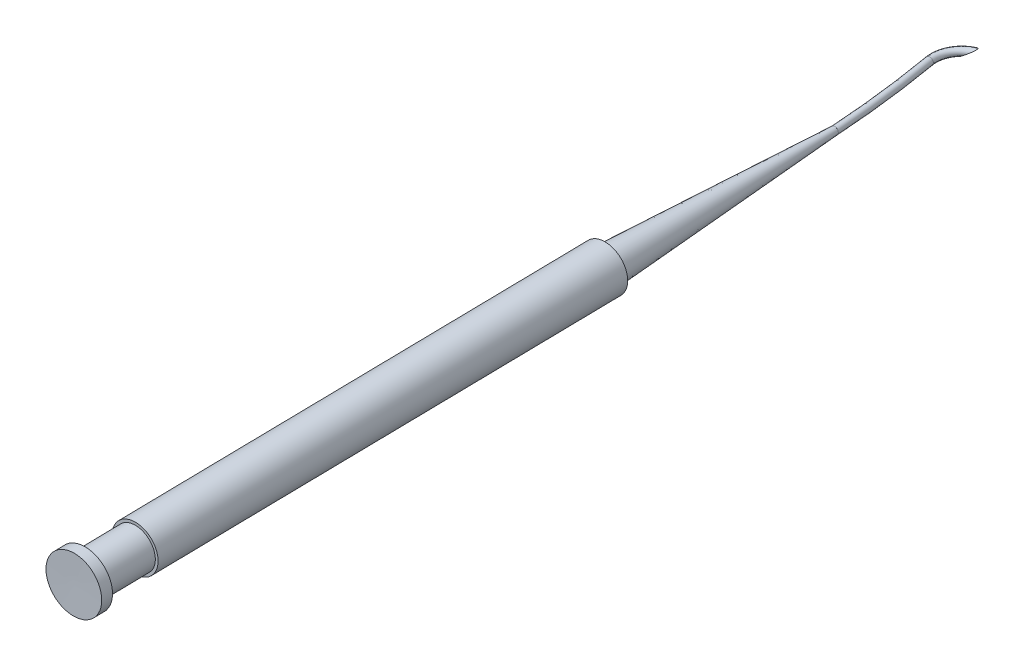
ISO-10303-21;
HEADER;
FILE_DESCRIPTION(('STEP AP214'),'2;1');
FILE_NAME('part.step','',(''),(''),'','','');
FILE_SCHEMA(('AUTOMOTIVE_DESIGN { 1 0 10303 214 1 1 1 1 }'));
ENDSEC;
DATA;
#1=APPLICATION_CONTEXT('core data for automotive mechanical design processes');
#2=APPLICATION_PROTOCOL_DEFINITION('international standard','automotive_design',2000,#1);
#3=PRODUCT_CONTEXT('',#1,'mechanical');
#4=PRODUCT('Part','Part','',(#3));
#5=PRODUCT_RELATED_PRODUCT_CATEGORY('part','',(#4));
#6=PRODUCT_DEFINITION_FORMATION('','',#4);
#7=PRODUCT_DEFINITION_CONTEXT('part definition',#1,'design');
#8=PRODUCT_DEFINITION('design','',#6,#7);
#9=PRODUCT_DEFINITION_SHAPE('','',#8);
#10=(LENGTH_UNIT() NAMED_UNIT(*) SI_UNIT(.MILLI.,.METRE.));
#11=(NAMED_UNIT(*) PLANE_ANGLE_UNIT() SI_UNIT($,.RADIAN.));
#12=(NAMED_UNIT(*) SI_UNIT($,.STERADIAN.) SOLID_ANGLE_UNIT());
#13=UNCERTAINTY_MEASURE_WITH_UNIT(LENGTH_MEASURE(1.E-05),#10,'distance_accuracy_value','');
#14=(GEOMETRIC_REPRESENTATION_CONTEXT(3) GLOBAL_UNCERTAINTY_ASSIGNED_CONTEXT((#13)) GLOBAL_UNIT_ASSIGNED_CONTEXT((#10,
#11,#12)) REPRESENTATION_CONTEXT('',''));
#15=CARTESIAN_POINT('',(0.,0.,0.));
#16=DIRECTION('',(0.,0.,1.));
#17=DIRECTION('',(1.,0.,0.));
#18=AXIS2_PLACEMENT_3D('',#15,#16,#17);
#19=CARTESIAN_POINT('',(22.5831114339788,9.8277538825437E-11,-64.5016753142618));
#20=DIRECTION('',(-0.109478747496273,1.17499877810958E-08,-0.993989136684424));
#21=DIRECTION('',(6.96705910834885E-07,-0.999999999999753,-8.8556780978676E-08));
#22=AXIS2_PLACEMENT_3D('',#19,#20,#21);
#23=ELLIPSE('',#22,0.499930018106646,0.499860046008388);
#24=CARTESIAN_POINT('',(26.3470233288516,0.,-65.1616041607414));
#25=DIRECTION('',(0.,-1.,0.));
#26=AXIS1_PLACEMENT('',#24,#25);
#27=SURFACE_OF_REVOLUTION('',#23,#26);
#28=CARTESIAN_POINT('',(22.583111782283,-0.499930018008245,-64.501675358534));
#29=VERTEX_POINT('',#28);
#30=EDGE_CURVE('E11',#29,#29,#23,.T.);
#31=ORIENTED_EDGE('',*,*,#30,.T.);
#32=EDGE_LOOP('',(#31));
#33=FACE_BOUND('',#32,.T.);
#34=CARTESIAN_POINT('',(23.4789167075342,-0.499930018008245,-67.6867775336271));
#35=CARTESIAN_POINT('',(23.4874966298607,-0.499922539838258,-67.6596179954472));
#36=CARTESIAN_POINT('',(23.4991178717487,-0.498113027047626,-67.633192326966));
#37=CARTESIAN_POINT('',(23.5220054699255,-0.491710849953837,-67.5974919130645));
#38=CARTESIAN_POINT('',(23.5306238073087,-0.488929440464561,-67.5861832491793));
#39=CARTESIAN_POINT('',(23.5495695594943,-0.482079781529989,-67.5655570977329));
#40=CARTESIAN_POINT('',(23.5598947935907,-0.478013168074712,-67.5562371038382));
#41=CARTESIAN_POINT('',(23.5802328042653,-0.469427725007459,-67.5411916823178));
#42=CARTESIAN_POINT('',(23.5900722557496,-0.465060905489362,-67.5351404864551));
#43=CARTESIAN_POINT('',(23.6103701263734,-0.455677162211372,-67.524819048566));
#44=CARTESIAN_POINT('',(23.6208296507264,-0.450659057451415,-67.5205521028228));
#45=CARTESIAN_POINT('',(23.6465426982068,-0.43794732030239,-67.5122249108725));
#46=CARTESIAN_POINT('',(23.6619523396238,-0.430019913611097,-67.5090157962757));
#47=CARTESIAN_POINT('',(23.6928245190423,-0.413668675975096,-67.5052883362523));
#48=CARTESIAN_POINT('',(23.7082870954326,-0.405243703576949,-67.5047764417567));
#49=CARTESIAN_POINT('',(23.737902559818,-0.388766205218424,-67.5057604163133));
#50=CARTESIAN_POINT('',(23.7520706037626,-0.380729598879681,-67.5071165661881));
#51=CARTESIAN_POINT('',(23.7801289796391,-0.364573667587392,-67.5111856553017));
#52=CARTESIAN_POINT('',(23.7940196214762,-0.356454452237391,-67.5138969808756));
#53=CARTESIAN_POINT('',(23.8215780275406,-0.340153652987961,-67.5203853907922));
#54=CARTESIAN_POINT('',(23.8352447778734,-0.33197194948345,-67.5241663783844));
#55=CARTESIAN_POINT('',(23.862315529857,-0.315607230266437,-67.5325689527492));
#56=CARTESIAN_POINT('',(23.8757194846719,-0.307424214577414,-67.5371906878794));
#57=CARTESIAN_POINT('',(23.9131667048235,-0.284378342511033,-67.5511656999159));
#58=CARTESIAN_POINT('',(23.9369315235763,-0.26953425252005,-67.5612937308752));
#59=CARTESIAN_POINT('',(23.9838007444835,-0.2399390323592,-67.5831083650033));
#60=CARTESIAN_POINT('',(24.0069046819498,-0.225187973020344,-67.5947960336085));
#61=CARTESIAN_POINT('',(24.0754823582676,-0.181035770327077,-67.6316051845266));
#62=CARTESIAN_POINT('',(24.1201344409228,-0.151790135457073,-67.6584362847414));
#63=CARTESIAN_POINT('',(24.2080464302558,-0.0935580425619982,-67.7150199966887));
#64=CARTESIAN_POINT('',(24.2512991348245,-0.0645733527040405,-67.7447852613265));
#65=CARTESIAN_POINT('',(24.3364346274478,-0.00699351117532545,-67.8064160904951));
#66=CARTESIAN_POINT('',(24.3783191605603,0.0216021072052781,-67.8382788097071));
#67=CARTESIAN_POINT('',(24.4568481353309,0.0756991068713183,-67.9008008977525));
#68=CARTESIAN_POINT('',(24.4936102773659,0.101234562084873,-67.9312833004158));
#69=CARTESIAN_POINT('',(24.5659116152841,0.151929616554021,-67.9939612209899));
#70=CARTESIAN_POINT('',(24.6014509539131,0.177089259485272,-68.0261565378161));
#71=CARTESIAN_POINT('',(24.6708393786765,0.226827798323792,-68.09256208874));
#72=CARTESIAN_POINT('',(24.7046922190613,0.251407913488138,-68.1267674406523));
#73=CARTESIAN_POINT('',(24.7699951949769,0.299719555552766,-68.1979096223693));
#74=CARTESIAN_POINT('',(24.8014481871818,0.323452072905243,-68.2348430982604));
#75=CARTESIAN_POINT('',(24.8554032558391,0.365513521509206,-68.305974306849));
#76=CARTESIAN_POINT('',(24.878515193272,0.384070965688318,-68.339554286647));
#77=CARTESIAN_POINT('',(24.9097141439607,0.410460886887004,-68.3925948880169));
#78=CARTESIAN_POINT('',(24.9195165470632,0.418998020381074,-68.4106743817307));
#79=CARTESIAN_POINT('',(24.9375847063136,0.43540519955492,-68.4478641190111));
#80=CARTESIAN_POINT('',(24.9458500252793,0.443275055100273,-68.4669746538416));
#81=CARTESIAN_POINT('',(24.9651088901834,0.462999797497797,-68.5194922396621));
#82=CARTESIAN_POINT('',(24.97429834211,0.474053290575408,-68.5540046282334));
#83=CARTESIAN_POINT('',(24.9807397230262,0.48695652639981,-68.6078808285763));
#84=CARTESIAN_POINT('',(24.9816409056787,0.490658613966195,-68.6263407510652));
#85=CARTESIAN_POINT('',(24.9802622323442,0.496336903765829,-68.6634081827675));
#86=CARTESIAN_POINT('',(24.9779915578946,0.498318060666896,-68.6820151116074));
#87=CARTESIAN_POINT('',(24.9709072673643,0.499993472269842,-68.7141230623619));
#88=CARTESIAN_POINT('',(24.9668435578089,0.500125692017693,-68.7277683711388));
#89=CARTESIAN_POINT('',(24.9567473800998,0.499168574704634,-68.7542670393061));
#90=CARTESIAN_POINT('',(24.950715091339,0.498079348929742,-68.7671204707322));
#91=CARTESIAN_POINT('',(24.9369407014494,0.494753154595339,-68.7916394276025));
#92=CARTESIAN_POINT('',(24.9292051402428,0.49252053390272,-68.8033092538599));
#93=CARTESIAN_POINT('',(24.9123305356752,0.487056331570419,-68.8253464878663));
#94=CARTESIAN_POINT('',(24.9031885634689,0.483822650664441,-68.8357110936466));
#95=CARTESIAN_POINT('',(24.8795434039081,0.474912354015089,-68.8593712627208));
#96=CARTESIAN_POINT('',(24.8644637242696,0.468788811244467,-68.8719211259236));
#97=CARTESIAN_POINT('',(24.8329329347905,0.455317201228225,-68.8943179881911));
#98=CARTESIAN_POINT('',(24.8164796927668,0.447967211818271,-68.9041606792511));
#99=CARTESIAN_POINT('',(24.7736534000257,0.42820232655429,-68.9261323510813));
#100=CARTESIAN_POINT('',(24.7467206293752,0.415195349504142,-68.9366266379133));
#101=CARTESIAN_POINT('',(24.6921115949708,0.387974875095077,-68.9530251465872));
#102=CARTESIAN_POINT('',(24.664433926231,0.373758969939492,-68.9589199585129));
#103=CARTESIAN_POINT('',(24.5916568693747,0.335511027576955,-68.9694224452733));
#104=CARTESIAN_POINT('',(24.546432758619,0.310874899963703,-68.970947118899));
#105=CARTESIAN_POINT('',(24.4568984012815,0.260765570710296,-68.9662790799544));
#106=CARTESIAN_POINT('',(24.412590240764,0.235290741499975,-68.9600703817609));
#107=CARTESIAN_POINT('',(24.3050282875379,0.172030851302187,-68.9368360446869));
#108=CARTESIAN_POINT('',(24.2426620946954,0.134089613158125,-68.9160969860722));
#109=CARTESIAN_POINT('',(24.1225717181909,0.0588247573493645,-68.8634577448738));
#110=CARTESIAN_POINT('',(24.0648490196514,0.0215013402889497,-68.8315540088234));
#111=CARTESIAN_POINT('',(23.9535113806371,-0.0527047813911042,-68.7572605928567));
#112=CARTESIAN_POINT('',(23.9000354623301,-0.0895530580752701,-68.714628384566));
#113=CARTESIAN_POINT('',(23.7997290483326,-0.161134029886636,-68.6204764933182));
#114=CARTESIAN_POINT('',(23.7529125367563,-0.195862188215514,-68.5689385972947));
#115=CARTESIAN_POINT('',(23.6607489040934,-0.267328339788732,-68.4496312111193));
#116=CARTESIAN_POINT('',(23.6166488268582,-0.303600887394179,-68.3805880735038));
#117=CARTESIAN_POINT('',(23.5604398690361,-0.353702808534918,-68.2703046880576));
#118=CARTESIAN_POINT('',(23.5433792232419,-0.369664178874372,-68.2324876618111));
#119=CARTESIAN_POINT('',(23.5130732009439,-0.399857506943634,-68.1547155081922));
#120=CARTESIAN_POINT('',(23.4998227803194,-0.414091736554149,-68.1147632913834));
#121=CARTESIAN_POINT('',(23.4800666254365,-0.437819019589966,-68.0407751943486));
#122=CARTESIAN_POINT('',(23.4727535852037,-0.447697298103827,-68.0070806956675));
#123=CARTESIAN_POINT('',(23.4618555497138,-0.465606902571051,-67.9385069522294));
#124=CARTESIAN_POINT('',(23.4582773539547,-0.473634839248143,-67.9036256656076));
#125=CARTESIAN_POINT('',(23.4562215016887,-0.486162908033941,-67.8380054319947));
#126=CARTESIAN_POINT('',(23.4571057804647,-0.490997735336491,-67.807362245954));
#127=CARTESIAN_POINT('',(23.4621681137548,-0.49615133724932,-67.7616370130987));
#128=CARTESIAN_POINT('',(23.4644674418326,-0.497518578106189,-67.7464742491026));
#129=CARTESIAN_POINT('',(23.4705193053329,-0.499410121126964,-67.7163950890753));
#130=CARTESIAN_POINT('',(23.4742724560723,-0.499934065888934,-67.7014788001533));
#131=CARTESIAN_POINT('',(23.4789167075342,-0.499930018008245,-67.6867775336271));
#132=B_SPLINE_CURVE_WITH_KNOTS('',3,(#34,#35,#36,#37,#38,#39,#40,#41,#42,#43,#44,#45,#46,#47,
#48,#49,#50,#51,#52,#53,#54,#55,#56,#57,#58,#59,#60,#61,#62,#63,#64,#65,#66,#67,#68,#69,#70,#71,
#72,#73,#74,#75,#76,#77,#78,#79,#80,#81,#82,#83,#84,#85,#86,#87,#88,#89,#90,#91,#92,#93,#94,#95,
#96,#97,#98,#99,#100,#101,#102,#103,#104,#105,#106,#107,#108,#109,#110,#111,#112,#113,#114,#115,
#116,#117,#118,#119,#120,#121,#122,#123,#124,#125,#126,#127,#128,#129,#130,#131),.UNSPECIFIED.,
.T.,.F.,(4,2,2,2,2,2,2,2,2,2,2,2,2,2,2,2,2,2,2,2,2,2,2,2,2,2,2,2,2,2,2,2,2,2,2,2,2,2,2,2,2,2,2,
2,2,2,2,2,4),(0.,0.0852063214918791,0.128417850991578,0.171574594786311,0.208448829189027,
0.245390888487316,0.297961542778718,0.350657873221296,0.399619614890309,0.448523194139345,
0.497607579136256,0.546700633933774,0.636006070123902,0.725372828943218,0.904433292210296,
1.08430283095376,1.26393320361352,1.4263614905045,1.58877075130074,1.75080065015548,
1.9126345650802,2.04670359965181,2.11342377830948,2.18016290479438,2.29098532503552,
2.34726672830694,2.40338555164556,2.4458999750825,2.48841052534095,2.53076061240355,
2.57320011800483,2.63450850384706,2.69591389441808,2.79047202555921,2.88522310653068,
3.03892907081035,3.19295328804407,3.41939855173804,3.64591595353208,3.87810443446597,
4.11077351006566,4.37793987580824,4.51111027966967,4.64410356720939,4.75149849939878,
4.85908861098387,4.95177021644145,4.9978722638897,5.04399384495915),.UNSPECIFIED.);
#133=CARTESIAN_POINT('',(23.4789167075342,-0.499930018008245,-67.6867775336271));
#134=VERTEX_POINT('',#133);
#135=EDGE_CURVE('E77',#134,#134,#132,.T.);
#136=ORIENTED_EDGE('',*,*,#135,.T.);
#137=EDGE_LOOP('',(#136));
#138=FACE_BOUND('',#137,.T.);
#139=ADVANCED_FACE('F40',(#33,#138),#27,.F.);
#140=CARTESIAN_POINT('',(22.5831114339788,9.8277538825437E-11,-64.5016753142618));
#141=DIRECTION('',(-0.109478747496273,1.17499877810958E-08,-0.993989136684424));
#142=DIRECTION('',(1.28637394537087E-09,1.,1.16793602105839E-08));
#143=AXIS2_PLACEMENT_3D('',#140,#141,#142);
#144=CIRCLE('',#143,0.150000000000002);
#145=CARTESIAN_POINT('',(26.3470233288516,0.,-65.1616041607414));
#146=DIRECTION('',(0.,-1.,0.));
#147=AXIS1_PLACEMENT('',#145,#146);
#148=SURFACE_OF_REVOLUTION('',#144,#147);
#149=CARTESIAN_POINT('',(22.5831114341717,0.150000000098279,-64.5016753125099));
#150=VERTEX_POINT('',#149);
#151=EDGE_CURVE('E48',#150,#150,#144,.T.);
#152=ORIENTED_EDGE('',*,*,#151,.F.);
#153=EDGE_LOOP('',(#152));
#154=FACE_BOUND('',#153,.T.);
#155=CARTESIAN_POINT('',(24.4157371071417,0.150000000098279,-68.4589777163875));
#156=CARTESIAN_POINT('',(24.4142710853937,0.150000076328208,-68.4636261695504));
#157=CARTESIAN_POINT('',(24.4124264922115,0.149771197351919,-68.4681565266262));
#158=CARTESIAN_POINT('',(24.407996312203,0.14883047526385,-68.4767855848725));
#159=CARTESIAN_POINT('',(24.4054109731304,0.148118793524122,-68.480884429743));
#160=CARTESIAN_POINT('',(24.3996298090631,0.146253939627511,-68.4884755007737));
#161=CARTESIAN_POINT('',(24.3964367746203,0.145102762236857,-68.4919703656355));
#162=CARTESIAN_POINT('',(24.3895921452486,0.142437384493779,-68.4983236240004));
#163=CARTESIAN_POINT('',(24.3859392136371,0.140922113748895,-68.5011800919848));
#164=CARTESIAN_POINT('',(24.3722910159743,0.134993995519197,-68.5103167298816));
#165=CARTESIAN_POINT('',(24.3614490571251,0.129805719551828,-68.5148163135146));
#166=CARTESIAN_POINT('',(24.3413683755161,0.119694529003867,-68.5202604157134));
#167=CARTESIAN_POINT('',(24.3321695772978,0.114875826470541,-68.5216784206928));
#168=CARTESIAN_POINT('',(24.3137742002582,0.104978710268638,-68.5230119424734));
#169=CARTESIAN_POINT('',(24.3045776895042,0.0998996533963149,-68.5229235398142));
#170=CARTESIAN_POINT('',(24.2788253887357,0.0853929683666589,-68.521039633179));
#171=CARTESIAN_POINT('',(24.2624540055977,0.0758328639094346,-68.5178966518499));
#172=CARTESIAN_POINT('',(24.2304894342157,0.0566811943063825,-68.5089622715144));
#173=CARTESIAN_POINT('',(24.2148981053724,0.0470896071275913,-68.5031648504195));
#174=CARTESIAN_POINT('',(24.1755083555094,0.0223183960099349,-68.4854138846467));
#175=CARTESIAN_POINT('',(24.1523758029141,0.00722609490043105,-68.4718520242186));
#176=CARTESIAN_POINT('',(24.1085932952459,-0.0223075205993808,-68.440605709956));
#177=CARTESIAN_POINT('',(24.0879477502232,-0.0367476510085163,-68.4229140916036));
#178=CARTESIAN_POINT('',(24.0531632149437,-0.0620720554242716,-68.3873769559858));
#179=CARTESIAN_POINT('',(24.0385235032155,-0.0731258437272038,-68.370142887424));
#180=CARTESIAN_POINT('',(24.0118895338344,-0.0941914602194916,-68.3332870983584));
#181=CARTESIAN_POINT('',(23.999882553516,-0.104208170185414,-68.3136776050732));
#182=CARTESIAN_POINT('',(23.9817683502355,-0.120676730825175,-68.2762804074247));
#183=CARTESIAN_POINT('',(23.9749489566109,-0.127433207029412,-68.2589965616805));
#184=CARTESIAN_POINT('',(23.9675395223182,-0.136250041297197,-68.2317196183609));
#185=CARTESIAN_POINT('',(23.9655363147787,-0.138981630016445,-68.2223419226479));
#186=CARTESIAN_POINT('',(23.9628896706269,-0.143754836759356,-68.2032483285854));
#187=CARTESIAN_POINT('',(23.962240546928,-0.145799310129542,-68.1935340196452));
#188=CARTESIAN_POINT('',(23.9629158322241,-0.14882076894991,-68.1739950655551));
#189=CARTESIAN_POINT('',(23.9642237681516,-0.149806546083709,-68.1641720244839));
#190=CARTESIAN_POINT('',(23.9682613492285,-0.150059583927777,-68.1499138690906));
#191=CARTESIAN_POINT('',(23.9699738323686,-0.149934030925493,-68.1452074013743));
#192=CARTESIAN_POINT('',(23.9741650761741,-0.149192146827235,-68.1361909532497));
#193=CARTESIAN_POINT('',(23.976642200099,-0.148576859625876,-68.1318801512333));
#194=CARTESIAN_POINT('',(23.9819467720588,-0.146955175806111,-68.1243999070223));
#195=CARTESIAN_POINT('',(23.9846867731105,-0.146010044738414,-68.1211549397557));
#196=CARTESIAN_POINT('',(23.9906097787375,-0.143777170406623,-68.1152332718524));
#197=CARTESIAN_POINT('',(23.9937934165104,-0.142488934995397,-68.1125573975152));
#198=CARTESIAN_POINT('',(24.0047918634678,-0.137789317660998,-68.1047479070574));
#199=CARTESIAN_POINT('',(24.0132749625436,-0.133785521041922,-68.1009066848671));
#200=CARTESIAN_POINT('',(24.0286605885956,-0.126105586377566,-68.0963487337598));
#201=CARTESIAN_POINT('',(24.0355090813711,-0.122545239928488,-68.0951365764617));
#202=CARTESIAN_POINT('',(24.049220115629,-0.115221223178427,-68.0938384865822));
#203=CARTESIAN_POINT('',(24.0560826515158,-0.111457086745429,-68.0937552557924));
#204=CARTESIAN_POINT('',(24.0762685672584,-0.100169458039263,-68.0947515982272));
#205=CARTESIAN_POINT('',(24.089446972998,-0.0925178256985973,-68.0970286588316));
#206=CARTESIAN_POINT('',(24.1152677579256,-0.077169270671369,-68.1035430372937));
#207=CARTESIAN_POINT('',(24.1279084080767,-0.0694722809809396,-68.107786222871));
#208=CARTESIAN_POINT('',(24.1537998501554,-0.0534240351346843,-68.1181054969046));
#209=CARTESIAN_POINT('',(24.1670002741928,-0.0450775165493272,-68.1243139969241));
#210=CARTESIAN_POINT('',(24.1928140028123,-0.0284918883147451,-68.1379739810225));
#211=CARTESIAN_POINT('',(24.2054267730467,-0.0202528811421779,-68.1454265691739));
#212=CARTESIAN_POINT('',(24.2424629749195,0.00429297695844041,-68.1693418335042));
#213=CARTESIAN_POINT('',(24.2660424617653,0.0204024331031969,-68.187343606528));
#214=CARTESIAN_POINT('',(24.3061414089616,0.0486569638720654,-68.2229034881995));
#215=CARTESIAN_POINT('',(24.3231283377878,0.0609491203730837,-68.239826407708));
#216=CARTESIAN_POINT('',(24.3548304118345,0.084696745897827,-68.2760571658182));
#217=CARTESIAN_POINT('',(24.3695575764629,0.0961564578001138,-68.2953513280148));
#218=CARTESIAN_POINT('',(24.3921307899944,0.114915590778805,-68.3318006802923));
#219=CARTESIAN_POINT('',(24.4007747048724,0.122532948679198,-68.3482569634334));
#220=CARTESIAN_POINT('',(24.4109663078961,0.132732900577533,-68.3746772325103));
#221=CARTESIAN_POINT('',(24.4139114573452,0.135946096884223,-68.3838416675271));
#222=CARTESIAN_POINT('',(24.4183481639022,0.141671652751077,-68.4027436323151));
#223=CARTESIAN_POINT('',(24.4198445597299,0.144186325114244,-68.4124791383809));
#224=CARTESIAN_POINT('',(24.4204752124066,0.147314916905457,-68.428494509047));
#225=CARTESIAN_POINT('',(24.4202944384096,0.14828795456778,-68.4346705335737));
#226=CARTESIAN_POINT('',(24.4188555914004,0.149628931822815,-68.4469539175333));
#227=CARTESIAN_POINT('',(24.4176029646854,0.149999903077762,-68.4530614662286));
#228=CARTESIAN_POINT('',(24.4157371071417,0.150000000098279,-68.4589777163875));
#229=B_SPLINE_CURVE_WITH_KNOTS('',3,(#155,#156,#157,#158,#159,#160,#161,#162,#163,#164,#165,
#166,#167,#168,#169,#170,#171,#172,#173,#174,#175,#176,#177,#178,#179,#180,#181,#182,#183,#184,
#185,#186,#187,#188,#189,#190,#191,#192,#193,#194,#195,#196,#197,#198,#199,#200,#201,#202,#203,
#204,#205,#206,#207,#208,#209,#210,#211,#212,#213,#214,#215,#216,#217,#218,#219,#220,#221,#222,
#223,#224,#225,#226,#227,#228),.UNSPECIFIED.,.T.,.F.,(4,2,2,2,2,2,2,2,2,2,2,2,2,2,2,2,2,2,2,2,2,
2,2,2,2,2,2,2,2,2,2,2,2,2,2,2,4),(0.,0.0145984966594061,0.029192116318066,0.0437202716644643,
0.0582916722487111,0.0960388982931043,0.127384676267737,0.158812023963596,0.2161525979892,
0.273623909277741,0.365453087278887,0.457442775089019,0.532726344778894,0.60763767092829,
0.666567260693061,0.696390747324982,0.726088722470404,0.755538124437427,0.770486715069125,
0.785403527038588,0.798380531650621,0.811376251608565,0.841165519472578,0.864525307246651,
0.8879409907518,0.933915205774559,0.980027519196332,1.03036898105267,1.08075535855007,
1.18168479164044,1.26237090172165,1.34261174986507,1.40249842443594,1.43285746010116,
1.46311474562402,1.48178909522111,1.50036911639283),.UNSPECIFIED.);
#230=CARTESIAN_POINT('',(24.4157371071417,0.150000000098279,-68.4589777163875));
#231=VERTEX_POINT('',#230);
#232=EDGE_CURVE('E71',#231,#231,#229,.T.);
#233=ORIENTED_EDGE('',*,*,#232,.F.);
#234=EDGE_LOOP('',(#233));
#235=FACE_BOUND('',#234,.T.);
#236=ADVANCED_FACE('F65',(#154,#235),#148,.T.);
#237=CARTESIAN_POINT('',(-110.498865130992,0.,-41.1686652008343));
#238=DIRECTION('',(0.,-1.,0.));
#239=AXIS1_PLACEMENT('',#237,#238);
#240=SURFACE_OF_REVOLUTION('',#144,#239);
#241=ORIENTED_EDGE('',*,*,#151,.T.);
#242=EDGE_LOOP('',(#241));
#243=FACE_BOUND('',#242,.T.);
#244=CARTESIAN_POINT('',(24.337642585616,9.8277538825437E-11,-49.7917756710677));
#245=DIRECTION('',(0.,1.17499877810958E-08,-1.));
#246=DIRECTION('',(0.,1.,1.17499877810958E-08));
#247=AXIS2_PLACEMENT_3D('',#244,#245,#246);
#248=CIRCLE('',#247,0.150000000000002);
#249=CARTESIAN_POINT('',(24.337642585616,0.150000000098279,-49.7917756693052));
#250=VERTEX_POINT('',#249);
#251=EDGE_CURVE('E56',#250,#250,#248,.T.);
#252=ORIENTED_EDGE('',*,*,#251,.F.);
#253=EDGE_LOOP('',(#252));
#254=FACE_BOUND('',#253,.T.);
#255=ADVANCED_FACE('F62',(#243,#254),#240,.F.);
#256=CARTESIAN_POINT('',(-110.498865130992,0.,-41.1686652008343));
#257=DIRECTION('',(0.,-1.,0.));
#258=AXIS1_PLACEMENT('',#256,#257);
#259=SURFACE_OF_REVOLUTION('',#23,#258);
#260=ORIENTED_EDGE('',*,*,#30,.F.);
#261=EDGE_LOOP('',(#260));
#262=FACE_BOUND('',#261,.T.);
#263=CARTESIAN_POINT('',(24.337642585616,9.8277538825437E-11,-49.7917756710677));
#264=DIRECTION('',(0.,1.17499877810958E-08,-1.));
#265=DIRECTION('',(7.0221319229755E-07,-0.999999999999753,-1.17499877810929E-08));
#266=AXIS2_PLACEMENT_3D('',#263,#264,#265);
#267=ELLIPSE('',#266,0.499930018106646,0.499860046008388);
#268=CARTESIAN_POINT('',(24.3376429366734,-0.499930018008245,-49.7917756769419));
#269=VERTEX_POINT('',#268);
#270=EDGE_CURVE('E52',#269,#269,#267,.T.);
#271=ORIENTED_EDGE('',*,*,#270,.T.);
#272=EDGE_LOOP('',(#271));
#273=FACE_BOUND('',#272,.T.);
#274=ADVANCED_FACE('F69',(#262,#273),#259,.T.);
#275=CARTESIAN_POINT('',(24.337642585616,9.8277538825437E-11,-49.7917756710677));
#276=DIRECTION('',(0.,1.17499877810958E-08,-1.));
#277=DIRECTION('',(0.,1.,1.17499877810958E-08));
#278=AXIS2_PLACEMENT_3D('',#275,#276,#277);
#279=PLANE('',#278);
#280=ORIENTED_EDGE('',*,*,#251,.T.);
#281=EDGE_LOOP('',(#280));
#282=FACE_BOUND('',#281,.T.);
#283=ORIENTED_EDGE('',*,*,#270,.F.);
#284=EDGE_LOOP('',(#283));
#285=FACE_BOUND('',#284,.T.);
#286=ADVANCED_FACE('F83',(#282,#285),#279,.F.);
#287=CARTESIAN_POINT('',(10.3994020225061,-18.8870061251815,-3.28005655924495));
#288=DIRECTION('',(0.476843512199102,-0.866025403784438,-0.150400348648619));
#289=DIRECTION('',(0.875989633236581,0.482329931128102,0.));
#290=AXIS2_PLACEMENT_3D('',#287,#288,#289);
#291=PLANE('',#290);
#292=ORIENTED_EDGE('',*,*,#135,.F.);
#293=EDGE_LOOP('',(#292));
#294=FACE_BOUND('',#293,.T.);
#295=ORIENTED_EDGE('',*,*,#232,.T.);
#296=EDGE_LOOP('',(#295));
#297=FACE_BOUND('',#296,.T.);
#298=ADVANCED_FACE('F80',(#294,#297),#291,.T.);
#299=CLOSED_SHELL('',(#139,#236,#255,#274,#286,#298));
#300=MANIFOLD_SOLID_BREP('B2',#299);
#301=CARTESIAN_POINT('',(24.337642585616,0.,-49.7834116165124));
#302=DIRECTION('',(0.0167304507679107,0.,0.999860036213621));
#303=DIRECTION('',(0.999860036213621,0.,-0.0167304507679107));
#304=AXIS2_PLACEMENT_3D('',#301,#302,#303);
#305=CONICAL_SURFACE('',#304,0.499930018106645,1.55406509543088);
#306=CARTESIAN_POINT('',(24.3375026316244,0.,-49.7917756710677));
#307=VERTEX_POINT('',#306);
#308=VERTEX_LOOP('',#307);
#309=FACE_BOUND('',#308,.T.);
#310=CARTESIAN_POINT('',(24.337642585616,0.,-49.7834116165124));
#311=DIRECTION('',(-0.0167304507679107,0.,-0.999860036213621));
#312=DIRECTION('',(-0.999860036213621,0.,0.0167304507679107));
#313=AXIS2_PLACEMENT_3D('',#310,#311,#312);
#314=CIRCLE('',#313,0.499930018106646);
#315=CARTESIAN_POINT('',(23.8377825396076,0.,-49.7750475619571));
#316=VERTEX_POINT('',#315);
#317=EDGE_CURVE('E38',#316,#316,#314,.T.);
#318=ORIENTED_EDGE('',*,*,#317,.T.);
#319=EDGE_LOOP('',(#318));
#320=FACE_BOUND('',#319,.T.);
#321=ADVANCED_FACE('F143',(#309,#320),#305,.T.);
#322=CARTESIAN_POINT('',(24.8726600990155,0.,-17.809220499765));
#323=DIRECTION('',(0.0167304507679107,0.,0.999860036213621));
#324=DIRECTION('',(0.999860036213621,0.,-0.0167304507679107));
#325=AXIS2_PLACEMENT_3D('',#322,#323,#324);
#326=CONICAL_SURFACE('',#325,2.29127121935524,0.0559582753425584);
#327=ORIENTED_EDGE('',*,*,#317,.F.);
#328=EDGE_LOOP('',(#327));
#329=FACE_BOUND('',#328,.T.);
#330=CARTESIAN_POINT('',(24.8726600990155,0.,-17.809220499765));
#331=DIRECTION('',(-0.0167304507679107,0.,-0.999860036213621));
#332=DIRECTION('',(-0.999860036213621,0.,0.0167304507679107));
#333=AXIS2_PLACEMENT_3D('',#330,#331,#332);
#334=CIRCLE('',#333,2.29127121935524);
#335=CARTESIAN_POINT('',(22.5817095746557,0.,-17.7708864994337));
#336=VERTEX_POINT('',#335);
#337=EDGE_CURVE('E150',#336,#336,#334,.T.);
#338=ORIENTED_EDGE('',*,*,#337,.T.);
#339=EDGE_LOOP('',(#338));
#340=FACE_BOUND('',#339,.T.);
#341=ADVANCED_FACE('F169',(#329,#340),#326,.T.);
#342=CARTESIAN_POINT('',(24.8728865003451,0.,-17.7956901027158));
#343=DIRECTION('',(0.0167304507679107,0.,0.999860036213621));
#344=DIRECTION('',(0.999860036213621,0.,-0.0167304507679107));
#345=AXIS2_PLACEMENT_3D('',#342,#343,#344);
#346=CONICAL_SURFACE('',#345,3.1,1.55406509543087);
#347=ORIENTED_EDGE('',*,*,#337,.F.);
#348=EDGE_LOOP('',(#347));
#349=FACE_BOUND('',#348,.T.);
#350=CARTESIAN_POINT('',(24.8728865003451,0.,-17.7956901027158));
#351=DIRECTION('',(-0.0167304507679107,0.,-0.999860036213621));
#352=DIRECTION('',(-0.999860036213621,0.,0.0167304507679107));
#353=AXIS2_PLACEMENT_3D('',#350,#351,#352);
#354=CIRCLE('',#353,3.1);
#355=CARTESIAN_POINT('',(21.7733203880829,0.,-17.7438257053353));
#356=VERTEX_POINT('',#355);
#357=EDGE_CURVE('E181',#356,#356,#354,.T.);
#358=ORIENTED_EDGE('',*,*,#357,.T.);
#359=EDGE_LOOP('',(#358));
#360=FACE_BOUND('',#359,.T.);
#361=ADVANCED_FACE('F173',(#349,#360),#346,.T.);
#362=CARTESIAN_POINT('',(24.8861041465377,0.,-17.0057654088692));
#363=DIRECTION('',(-0.0167304507679107,0.,-0.999860036213621));
#364=DIRECTION('',(-0.999860036213621,0.,0.0167304507679107));
#365=AXIS2_PLACEMENT_3D('',#362,#363,#364);
#366=CYLINDRICAL_SURFACE('',#365,3.1);
#367=ORIENTED_EDGE('',*,*,#357,.F.);
#368=EDGE_LOOP('',(#367));
#369=FACE_BOUND('',#368,.T.);
#370=CARTESIAN_POINT('',(25.9660800783786,0.,47.5367140078499));
#371=DIRECTION('',(-0.0167304507679107,0.,-0.999860036213621));
#372=DIRECTION('',(-0.999860036213621,0.,0.0167304507679107));
#373=AXIS2_PLACEMENT_3D('',#370,#371,#372);
#374=CIRCLE('',#373,3.1);
#375=CARTESIAN_POINT('',(22.8665139661164,0.,47.5885784052304));
#376=VERTEX_POINT('',#375);
#377=EDGE_CURVE('E183',#376,#376,#374,.T.);
#378=ORIENTED_EDGE('',*,*,#377,.T.);
#379=EDGE_LOOP('',(#378));
#380=FACE_BOUND('',#379,.T.);
#381=ADVANCED_FACE('F216',(#369,#380),#366,.T.);
#382=CARTESIAN_POINT('',(25.9659750981916,0.,47.5304400888119));
#383=DIRECTION('',(0.0167304507679107,0.,0.999860036213621));
#384=DIRECTION('',(0.999860036213621,0.,-0.0167304507679107));
#385=AXIS2_PLACEMENT_3D('',#382,#383,#384);
#386=CONICAL_SURFACE('',#385,2.725,1.55406509543086);
#387=ORIENTED_EDGE('',*,*,#377,.F.);
#388=EDGE_LOOP('',(#387));
#389=FACE_BOUND('',#388,.T.);
#390=CARTESIAN_POINT('',(25.9659750981916,0.,47.5304400888119));
#391=DIRECTION('',(-0.0167304507679107,0.,-0.999860036213621));
#392=DIRECTION('',(-0.999860036213621,0.,0.0167304507679107));
#393=AXIS2_PLACEMENT_3D('',#390,#391,#392);
#394=CIRCLE('',#393,2.725);
#395=CARTESIAN_POINT('',(23.2413564995095,0.,47.5760305671545));
#396=VERTEX_POINT('',#395);
#397=EDGE_CURVE('E188',#396,#396,#394,.T.);
#398=ORIENTED_EDGE('',*,*,#397,.T.);
#399=EDGE_LOOP('',(#398));
#400=FACE_BOUND('',#399,.T.);
#401=ADVANCED_FACE('F209',(#389,#400),#386,.F.);
#402=CARTESIAN_POINT('',(24.8861041465377,0.,-17.0057654088692));
#403=DIRECTION('',(-0.0167304507679107,0.,-0.999860036213621));
#404=DIRECTION('',(-0.999860036213621,0.,0.0167304507679107));
#405=AXIS2_PLACEMENT_3D('',#402,#403,#404);
#406=CYLINDRICAL_SURFACE('',#405,2.725);
#407=ORIENTED_EDGE('',*,*,#397,.F.);
#408=EDGE_LOOP('',(#407));
#409=FACE_BOUND('',#408,.T.);
#410=CARTESIAN_POINT('',(26.083088253567,0.,54.5294603423073));
#411=DIRECTION('',(-0.0167304507679107,0.,-0.999860036213621));
#412=DIRECTION('',(-0.999860036213621,0.,0.0167304507679107));
#413=AXIS2_PLACEMENT_3D('',#410,#411,#412);
#414=CIRCLE('',#413,2.725);
#415=CARTESIAN_POINT('',(23.3584696548849,0.,54.5750508206498));
#416=VERTEX_POINT('',#415);
#417=EDGE_CURVE('E191',#416,#416,#414,.T.);
#418=ORIENTED_EDGE('',*,*,#417,.T.);
#419=EDGE_LOOP('',(#418));
#420=FACE_BOUND('',#419,.T.);
#421=ADVANCED_FACE('F203',(#409,#420),#406,.T.);
#422=CARTESIAN_POINT('',(26.0833751994115,0.,54.5466090543444));
#423=DIRECTION('',(0.0167304507679107,0.,0.999860036213621));
#424=DIRECTION('',(0.999860036213621,0.,-0.0167304507679107));
#425=AXIS2_PLACEMENT_3D('',#422,#423,#424);
#426=CONICAL_SURFACE('',#425,3.75,1.55406509543086);
#427=ORIENTED_EDGE('',*,*,#417,.F.);
#428=EDGE_LOOP('',(#427));
#429=FACE_BOUND('',#428,.T.);
#430=CARTESIAN_POINT('',(26.0833751994115,0.,54.5466090543444));
#431=DIRECTION('',(-0.0167304507679107,0.,-0.999860036213621));
#432=DIRECTION('',(-0.999860036213621,0.,0.0167304507679107));
#433=AXIS2_PLACEMENT_3D('',#430,#431,#432);
#434=CIRCLE('',#433,3.75);
#435=CARTESIAN_POINT('',(22.3339000636104,0.,54.609348244724));
#436=VERTEX_POINT('',#435);
#437=EDGE_CURVE('E194',#436,#436,#434,.T.);
#438=ORIENTED_EDGE('',*,*,#437,.T.);
#439=EDGE_LOOP('',(#438));
#440=FACE_BOUND('',#439,.T.);
#441=ADVANCED_FACE('F164',(#429,#440),#426,.T.);
#442=CARTESIAN_POINT('',(24.8861041465377,0.,-17.0057654088692));
#443=DIRECTION('',(-0.0167304507679107,0.,-0.999860036213621));
#444=DIRECTION('',(-0.999860036213621,0.,0.0167304507679107));
#445=AXIS2_PLACEMENT_3D('',#442,#443,#444);
#446=CYLINDRICAL_SURFACE('',#445,3.75);
#447=ORIENTED_EDGE('',*,*,#437,.F.);
#448=EDGE_LOOP('',(#447));
#449=FACE_BOUND('',#448,.T.);
#450=CARTESIAN_POINT('',(26.1084708755634,0.,56.0463991086648));
#451=DIRECTION('',(-0.0167304507679107,0.,-0.999860036213621));
#452=DIRECTION('',(-0.999860036213621,0.,0.0167304507679107));
#453=AXIS2_PLACEMENT_3D('',#450,#451,#452);
#454=CIRCLE('',#453,3.75);
#455=CARTESIAN_POINT('',(22.3589957397623,0.,56.1091382990445));
#456=VERTEX_POINT('',#455);
#457=EDGE_CURVE('E197',#456,#456,#454,.T.);
#458=ORIENTED_EDGE('',*,*,#457,.T.);
#459=EDGE_LOOP('',(#458));
#460=FACE_BOUND('',#459,.T.);
#461=ADVANCED_FACE('F158',(#449,#460),#446,.T.);
#462=CARTESIAN_POINT('',(26.1074210736933,0.,55.9836599182852));
#463=DIRECTION('',(0.0167304507679107,0.,0.999860036213621));
#464=DIRECTION('',(0.999860036213621,0.,-0.0167304507679107));
#465=AXIS2_PLACEMENT_3D('',#462,#463,#464);
#466=CONICAL_SURFACE('',#465,0.,1.55406509543088);
#467=ORIENTED_EDGE('',*,*,#457,.F.);
#468=EDGE_LOOP('',(#467));
#469=FACE_BOUND('',#468,.T.);
#470=CARTESIAN_POINT('',(26.1074210736933,0.,55.9836599182852));
#471=VERTEX_POINT('',#470);
#472=VERTEX_LOOP('',#471);
#473=FACE_BOUND('',#472,.T.);
#474=ADVANCED_FACE('F156',(#469,#473),#466,.F.);
#475=CLOSED_SHELL('',(#321,#341,#361,#381,#401,#421,#441,#461,#474));
#476=MANIFOLD_SOLID_BREP('B6',#475);
#477=ADVANCED_BREP_SHAPE_REPRESENTATION('',(#18,#300,#476),#14);
#478=SHAPE_DEFINITION_REPRESENTATION(#9,#477);
ENDSEC;
END-ISO-10303-21;
